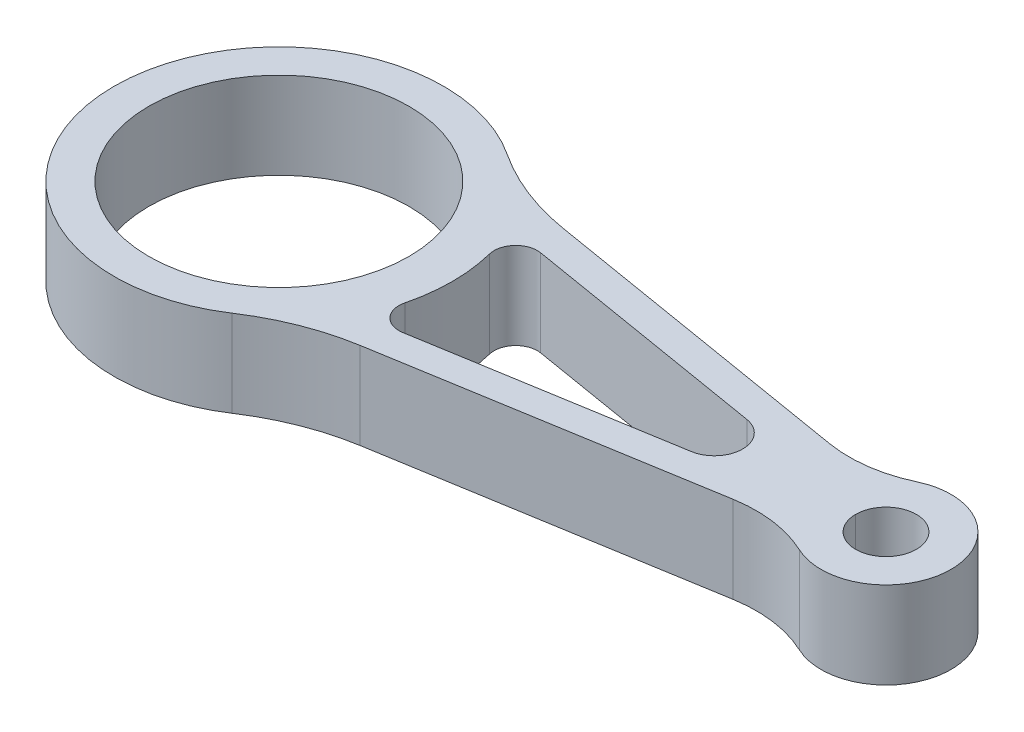
ISO-10303-21;
HEADER;
FILE_DESCRIPTION(('STEP AP214'),'2;1');
FILE_NAME('part.step','',(''),(''),'','','');
FILE_SCHEMA(('AUTOMOTIVE_DESIGN { 1 0 10303 214 1 1 1 1 }'));
ENDSEC;
DATA;
#1=APPLICATION_CONTEXT('core data for automotive mechanical design processes');
#2=APPLICATION_PROTOCOL_DEFINITION('international standard','automotive_design',2000,#1);
#3=PRODUCT_CONTEXT('',#1,'mechanical');
#4=PRODUCT('Part','Part','',(#3));
#5=PRODUCT_RELATED_PRODUCT_CATEGORY('part','',(#4));
#6=PRODUCT_DEFINITION_FORMATION('','',#4);
#7=PRODUCT_DEFINITION_CONTEXT('part definition',#1,'design');
#8=PRODUCT_DEFINITION('design','',#6,#7);
#9=PRODUCT_DEFINITION_SHAPE('','',#8);
#10=(LENGTH_UNIT() NAMED_UNIT(*) SI_UNIT(.MILLI.,.METRE.));
#11=(NAMED_UNIT(*) PLANE_ANGLE_UNIT() SI_UNIT($,.RADIAN.));
#12=(NAMED_UNIT(*) SI_UNIT($,.STERADIAN.) SOLID_ANGLE_UNIT());
#13=UNCERTAINTY_MEASURE_WITH_UNIT(LENGTH_MEASURE(1.E-05),#10,'distance_accuracy_value','');
#14=(GEOMETRIC_REPRESENTATION_CONTEXT(3) GLOBAL_UNCERTAINTY_ASSIGNED_CONTEXT((#13)) GLOBAL_UNIT_ASSIGNED_CONTEXT((#10,
#11,#12)) REPRESENTATION_CONTEXT('',''));
#15=CARTESIAN_POINT('',(0.,0.,0.));
#16=DIRECTION('',(0.,0.,1.));
#17=DIRECTION('',(1.,0.,0.));
#18=AXIS2_PLACEMENT_3D('',#15,#16,#17);
#19=CARTESIAN_POINT('',(140.,10.,0.));
#20=DIRECTION('',(0.,-1.,0.));
#21=DIRECTION('',(0.,0.,-1.));
#22=AXIS2_PLACEMENT_3D('',#19,#20,#21);
#23=CYLINDRICAL_SURFACE('',#22,7.00000000000001);
#24=CARTESIAN_POINT('',(140.,10.,0.));
#25=DIRECTION('',(0.,1.,0.));
#26=DIRECTION('',(0.,0.,1.));
#27=AXIS2_PLACEMENT_3D('',#24,#25,#26);
#28=CIRCLE('',#27,7.00000000000001);
#29=CARTESIAN_POINT('',(147.,10.,0.));
#30=VERTEX_POINT('',#29);
#31=CARTESIAN_POINT('',(133.,10.,0.));
#32=VERTEX_POINT('',#31);
#33=EDGE_CURVE('E230',#30,#32,#28,.T.);
#34=ORIENTED_EDGE('',*,*,#33,.T.);
#35=DIRECTION('',(0.,-1.,0.));
#36=VECTOR('',#35,1.);
#37=CARTESIAN_POINT('',(133.,10.,0.));
#38=LINE('',#37,#36);
#39=CARTESIAN_POINT('',(133.,-10.,0.));
#40=VERTEX_POINT('',#39);
#41=EDGE_CURVE('E11',#32,#40,#38,.T.);
#42=ORIENTED_EDGE('',*,*,#41,.T.);
#43=CARTESIAN_POINT('',(140.,-10.,0.));
#44=DIRECTION('',(0.,1.,0.));
#45=DIRECTION('',(0.,0.,1.));
#46=AXIS2_PLACEMENT_3D('',#43,#44,#45);
#47=CIRCLE('',#46,7.00000000000001);
#48=CARTESIAN_POINT('',(147.,-10.,0.));
#49=VERTEX_POINT('',#48);
#50=EDGE_CURVE('E235',#49,#40,#47,.T.);
#51=ORIENTED_EDGE('',*,*,#50,.F.);
#52=DIRECTION('',(0.,1.,0.));
#53=VECTOR('',#52,1.);
#54=CARTESIAN_POINT('',(147.,10.,0.));
#55=LINE('',#54,#53);
#56=EDGE_CURVE('E52',#49,#30,#55,.T.);
#57=ORIENTED_EDGE('',*,*,#56,.T.);
#58=EDGE_LOOP('',(#34,#42,#51,#57));
#59=FACE_BOUND('',#58,.T.);
#60=ADVANCED_FACE('F43',(#59),#23,.F.);
#61=CARTESIAN_POINT('',(140.,10.,0.));
#62=DIRECTION('',(0.,1.,0.));
#63=DIRECTION('',(0.,0.,1.));
#64=AXIS2_PLACEMENT_3D('',#61,#62,#63);
#65=PLANE('',#64);
#66=CARTESIAN_POINT('',(43.6399445937841,10.,-10.9797648358905));
#67=DIRECTION('',(0.,1.,0.));
#68=DIRECTION('',(0.,0.,1.));
#69=AXIS2_PLACEMENT_3D('',#66,#67,#68);
#70=CIRCLE('',#69,5.);
#71=CARTESIAN_POINT('',(44.4613731652126,10.,-15.9118288158121));
#72=VERTEX_POINT('',#71);
#73=CARTESIAN_POINT('',(38.7910618611414,10.,-9.75979096523596));
#74=VERTEX_POINT('',#73);
#75=EDGE_CURVE('E174',#72,#74,#70,.T.);
#76=ORIENTED_EDGE('',*,*,#75,.F.);
#77=DIRECTION('',(0.986412795984335,0.,0.164285714285714));
#78=VECTOR('',#77,1.);
#79=CARTESIAN_POINT('',(44.4613731652126,10.,-15.9118288158121));
#80=LINE('',#79,#78);
#81=CARTESIAN_POINT('',(101.502639751553,10.,-6.41168317389818));
#82=VERTEX_POINT('',#81);
#83=EDGE_CURVE('E182',#72,#82,#80,.T.);
#84=ORIENTED_EDGE('',*,*,#83,.T.);
#85=CARTESIAN_POINT('',(100.434782608696,10.,0.));
#86=DIRECTION('',(0.,-1.,0.));
#87=DIRECTION('',(0.,0.,-1.));
#88=AXIS2_PLACEMENT_3D('',#85,#86,#87);
#89=CIRCLE('',#88,6.50000000000001);
#90=CARTESIAN_POINT('',(101.502639751553,10.,6.41168317389818));
#91=VERTEX_POINT('',#90);
#92=EDGE_CURVE('E186',#82,#91,#89,.T.);
#93=ORIENTED_EDGE('',*,*,#92,.T.);
#94=DIRECTION('',(-0.986412795984335,0.,0.164285714285714));
#95=VECTOR('',#94,1.);
#96=CARTESIAN_POINT('',(101.502639751553,10.,6.41168317389818));
#97=LINE('',#96,#95);
#98=CARTESIAN_POINT('',(44.4613731652126,10.,15.9118288158121));
#99=VERTEX_POINT('',#98);
#100=EDGE_CURVE('E208',#91,#99,#97,.T.);
#101=ORIENTED_EDGE('',*,*,#100,.T.);
#102=CARTESIAN_POINT('',(43.6399445937841,10.,10.9797648358905));
#103=DIRECTION('',(0.,-1.,0.));
#104=DIRECTION('',(0.,0.,-1.));
#105=AXIS2_PLACEMENT_3D('',#102,#103,#104);
#106=CIRCLE('',#105,5.);
#107=CARTESIAN_POINT('',(38.7910618611414,10.,9.75979096523597));
#108=VERTEX_POINT('',#107);
#109=EDGE_CURVE('E204',#99,#108,#106,.T.);
#110=ORIENTED_EDGE('',*,*,#109,.T.);
#111=CARTESIAN_POINT('',(0.,10.,0.));
#112=DIRECTION('',(0.,1.,0.));
#113=DIRECTION('',(0.,0.,1.));
#114=AXIS2_PLACEMENT_3D('',#111,#112,#113);
#115=CIRCLE('',#114,40.);
#116=EDGE_CURVE('E201',#108,#74,#115,.T.);
#117=ORIENTED_EDGE('',*,*,#116,.T.);
#118=EDGE_LOOP('',(#76,#84,#93,#101,#110,#117));
#119=FACE_BOUND('',#118,.T.);
#120=CARTESIAN_POINT('',(0.,10.,0.));
#121=DIRECTION('',(0.,1.,0.));
#122=DIRECTION('',(0.,0.,1.));
#123=AXIS2_PLACEMENT_3D('',#120,#121,#122);
#124=CIRCLE('',#123,30.);
#125=CARTESIAN_POINT('',(0.,10.,30.));
#126=VERTEX_POINT('',#125);
#127=EDGE_CURVE('E239',#126,#126,#124,.T.);
#128=ORIENTED_EDGE('',*,*,#127,.F.);
#129=EDGE_LOOP('',(#128));
#130=FACE_BOUND('',#129,.T.);
#131=CARTESIAN_POINT('',(0.,10.,0.));
#132=DIRECTION('',(0.,1.,0.));
#133=DIRECTION('',(0.,0.,1.));
#134=AXIS2_PLACEMENT_3D('',#131,#132,#133);
#135=CIRCLE('',#134,38.);
#136=CARTESIAN_POINT('',(20.915316262523,10.,-31.7261650004951));
#137=VERTEX_POINT('',#136);
#138=CARTESIAN_POINT('',(20.915316262523,10.,31.7261650004951));
#139=VERTEX_POINT('',#138);
#140=EDGE_CURVE('E256',#137,#139,#135,.T.);
#141=ORIENTED_EDGE('',*,*,#140,.T.);
#142=CARTESIAN_POINT('',(51.1874845372273,10.,77.645614343317));
#143=DIRECTION('',(0.,1.,0.));
#144=DIRECTION('',(0.,0.,1.));
#145=AXIS2_PLACEMENT_3D('',#142,#143,#144);
#146=CIRCLE('',#145,55.);
#147=CARTESIAN_POINT('',(42.151770251513,10.,23.3929105641786));
#148=VERTEX_POINT('',#147);
#149=EDGE_CURVE('E321',#139,#148,#146,.F.);
#150=ORIENTED_EDGE('',*,*,#149,.T.);
#151=DIRECTION('',(0.986412795984335,0.,-0.164285714285714));
#152=VECTOR('',#151,1.);
#153=CARTESIAN_POINT('',(128.063755469258,10.,9.08438586269532));
#154=LINE('',#153,#152);
#155=CARTESIAN_POINT('',(115.885505271675,10.,11.1126569279176));
#156=VERTEX_POINT('',#155);
#157=EDGE_CURVE('E260',#148,#156,#154,.T.);
#158=ORIENTED_EDGE('',*,*,#157,.T.);
#159=CARTESIAN_POINT('',(120.814076700247,10.,40.7050408074477));
#160=DIRECTION('',(0.,1.,0.));
#161=DIRECTION('',(0.,0.,1.));
#162=AXIS2_PLACEMENT_3D('',#159,#160,#161);
#163=CIRCLE('',#162,30.);
#164=CARTESIAN_POINT('',(133.604692233416,10.,13.5683469358159));
#165=VERTEX_POINT('',#164);
#166=EDGE_CURVE('E295',#156,#165,#163,.F.);
#167=ORIENTED_EDGE('',*,*,#166,.T.);
#168=CARTESIAN_POINT('',(140.,10.,0.));
#169=DIRECTION('',(0.,1.,0.));
#170=DIRECTION('',(0.,0.,1.));
#171=AXIS2_PLACEMENT_3D('',#168,#169,#170);
#172=CIRCLE('',#171,15.);
#173=CARTESIAN_POINT('',(133.604692233416,10.,-13.5683469358159));
#174=VERTEX_POINT('',#173);
#175=EDGE_CURVE('E247',#165,#174,#172,.T.);
#176=ORIENTED_EDGE('',*,*,#175,.T.);
#177=CARTESIAN_POINT('',(120.814076700247,10.,-40.7050408074477));
#178=DIRECTION('',(0.,1.,0.));
#179=DIRECTION('',(0.,0.,1.));
#180=AXIS2_PLACEMENT_3D('',#177,#178,#179);
#181=CIRCLE('',#180,30.);
#182=CARTESIAN_POINT('',(115.885505271675,10.,-11.1126569279176));
#183=VERTEX_POINT('',#182);
#184=EDGE_CURVE('E301',#174,#183,#181,.F.);
#185=ORIENTED_EDGE('',*,*,#184,.T.);
#186=DIRECTION('',(-0.986412795984335,0.,-0.164285714285714));
#187=VECTOR('',#186,1.);
#188=CARTESIAN_POINT('',(128.063755469258,10.,-9.08438586269532));
#189=LINE('',#188,#187);
#190=CARTESIAN_POINT('',(42.151770251513,10.,-23.3929105641786));
#191=VERTEX_POINT('',#190);
#192=EDGE_CURVE('E251',#183,#191,#189,.T.);
#193=ORIENTED_EDGE('',*,*,#192,.T.);
#194=CARTESIAN_POINT('',(51.1874845372273,10.,-77.645614343317));
#195=DIRECTION('',(0.,1.,0.));
#196=DIRECTION('',(0.,0.,1.));
#197=AXIS2_PLACEMENT_3D('',#194,#195,#196);
#198=CIRCLE('',#197,55.);
#199=EDGE_CURVE('E327',#191,#137,#198,.F.);
#200=ORIENTED_EDGE('',*,*,#199,.T.);
#201=EDGE_LOOP('',(#141,#150,#158,#167,#176,#185,#193,#200));
#202=FACE_BOUND('',#201,.T.);
#203=ORIENTED_EDGE('',*,*,#33,.F.);
#204=EDGE_CURVE('E234',#32,#30,#28,.T.);
#205=ORIENTED_EDGE('',*,*,#204,.F.);
#206=EDGE_LOOP('',(#203,#205));
#207=FACE_BOUND('',#206,.T.);
#208=ADVANCED_FACE('F335',(#119,#130,#202,#207),#65,.T.);
#209=CARTESIAN_POINT('',(140.,-10.,0.));
#210=DIRECTION('',(0.,1.,0.));
#211=DIRECTION('',(0.,0.,1.));
#212=AXIS2_PLACEMENT_3D('',#209,#210,#211);
#213=PLANE('',#212);
#214=DIRECTION('',(0.986412795984335,0.,0.164285714285714));
#215=VECTOR('',#214,1.);
#216=CARTESIAN_POINT('',(44.4613731652126,-10.,-15.9118288158121));
#217=LINE('',#216,#215);
#218=CARTESIAN_POINT('',(44.4613731652126,-10.,-15.9118288158121));
#219=VERTEX_POINT('',#218);
#220=CARTESIAN_POINT('',(101.502639751553,-10.,-6.41168317389818));
#221=VERTEX_POINT('',#220);
#222=EDGE_CURVE('E176',#219,#221,#217,.T.);
#223=ORIENTED_EDGE('',*,*,#222,.F.);
#224=CARTESIAN_POINT('',(43.6399445937841,-10.,-10.9797648358905));
#225=DIRECTION('',(0.,1.,0.));
#226=DIRECTION('',(0.,0.,1.));
#227=AXIS2_PLACEMENT_3D('',#224,#225,#226);
#228=CIRCLE('',#227,5.);
#229=CARTESIAN_POINT('',(38.7910618611414,-10.,-9.75979096523596));
#230=VERTEX_POINT('',#229);
#231=EDGE_CURVE('E167',#219,#230,#228,.T.);
#232=ORIENTED_EDGE('',*,*,#231,.T.);
#233=CARTESIAN_POINT('',(0.,-10.,0.));
#234=DIRECTION('',(0.,1.,0.));
#235=DIRECTION('',(0.,0.,1.));
#236=AXIS2_PLACEMENT_3D('',#233,#234,#235);
#237=CIRCLE('',#236,40.);
#238=CARTESIAN_POINT('',(38.7910618611414,-10.,9.75979096523597));
#239=VERTEX_POINT('',#238);
#240=EDGE_CURVE('E154',#239,#230,#237,.T.);
#241=ORIENTED_EDGE('',*,*,#240,.F.);
#242=CARTESIAN_POINT('',(43.6399445937841,-10.,10.9797648358905));
#243=DIRECTION('',(0.,-1.,0.));
#244=DIRECTION('',(0.,0.,-1.));
#245=AXIS2_PLACEMENT_3D('',#242,#243,#244);
#246=CIRCLE('',#245,5.);
#247=CARTESIAN_POINT('',(44.4613731652126,-10.,15.9118288158121));
#248=VERTEX_POINT('',#247);
#249=EDGE_CURVE('E166',#248,#239,#246,.T.);
#250=ORIENTED_EDGE('',*,*,#249,.F.);
#251=DIRECTION('',(-0.986412795984335,0.,0.164285714285714));
#252=VECTOR('',#251,1.);
#253=CARTESIAN_POINT('',(101.502639751553,-10.,6.41168317389818));
#254=LINE('',#253,#252);
#255=CARTESIAN_POINT('',(101.502639751553,-10.,6.41168317389818));
#256=VERTEX_POINT('',#255);
#257=EDGE_CURVE('E191',#256,#248,#254,.T.);
#258=ORIENTED_EDGE('',*,*,#257,.F.);
#259=CARTESIAN_POINT('',(100.434782608696,-10.,0.));
#260=DIRECTION('',(0.,-1.,0.));
#261=DIRECTION('',(0.,0.,-1.));
#262=AXIS2_PLACEMENT_3D('',#259,#260,#261);
#263=CIRCLE('',#262,6.50000000000001);
#264=EDGE_CURVE('E194',#221,#256,#263,.T.);
#265=ORIENTED_EDGE('',*,*,#264,.F.);
#266=EDGE_LOOP('',(#223,#232,#241,#250,#258,#265));
#267=FACE_BOUND('',#266,.T.);
#268=CARTESIAN_POINT('',(140.,-10.,0.));
#269=DIRECTION('',(0.,1.,0.));
#270=DIRECTION('',(0.,0.,1.));
#271=AXIS2_PLACEMENT_3D('',#268,#269,#270);
#272=CIRCLE('',#271,15.);
#273=CARTESIAN_POINT('',(133.604692233416,-10.,13.5683469358159));
#274=VERTEX_POINT('',#273);
#275=CARTESIAN_POINT('',(133.604692233416,-10.,-13.5683469358159));
#276=VERTEX_POINT('',#275);
#277=EDGE_CURVE('E243',#274,#276,#272,.T.);
#278=ORIENTED_EDGE('',*,*,#277,.F.);
#279=CARTESIAN_POINT('',(120.814076700247,-10.,40.7050408074477));
#280=DIRECTION('',(0.,1.,0.));
#281=DIRECTION('',(0.,0.,1.));
#282=AXIS2_PLACEMENT_3D('',#279,#280,#281);
#283=CIRCLE('',#282,30.);
#284=CARTESIAN_POINT('',(115.885505271675,-10.,11.1126569279176));
#285=VERTEX_POINT('',#284);
#286=EDGE_CURVE('E291',#274,#285,#283,.T.);
#287=ORIENTED_EDGE('',*,*,#286,.T.);
#288=DIRECTION('',(0.986412795984335,0.,-0.164285714285714));
#289=VECTOR('',#288,1.);
#290=CARTESIAN_POINT('',(128.063755469258,-10.,9.08438586269532));
#291=LINE('',#290,#289);
#292=CARTESIAN_POINT('',(42.151770251513,-10.,23.3929105641786));
#293=VERTEX_POINT('',#292);
#294=EDGE_CURVE('E252',#293,#285,#291,.T.);
#295=ORIENTED_EDGE('',*,*,#294,.F.);
#296=CARTESIAN_POINT('',(51.1874845372273,-10.,77.645614343317));
#297=DIRECTION('',(0.,1.,0.));
#298=DIRECTION('',(0.,0.,1.));
#299=AXIS2_PLACEMENT_3D('',#296,#297,#298);
#300=CIRCLE('',#299,55.);
#301=CARTESIAN_POINT('',(20.915316262523,-10.,31.7261650004951));
#302=VERTEX_POINT('',#301);
#303=EDGE_CURVE('E318',#293,#302,#300,.T.);
#304=ORIENTED_EDGE('',*,*,#303,.T.);
#305=CARTESIAN_POINT('',(0.,-10.,0.));
#306=DIRECTION('',(0.,1.,0.));
#307=DIRECTION('',(0.,0.,1.));
#308=AXIS2_PLACEMENT_3D('',#305,#306,#307);
#309=CIRCLE('',#308,38.);
#310=CARTESIAN_POINT('',(20.915316262523,-10.,-31.7261650004951));
#311=VERTEX_POINT('',#310);
#312=EDGE_CURVE('E271',#311,#302,#309,.T.);
#313=ORIENTED_EDGE('',*,*,#312,.F.);
#314=CARTESIAN_POINT('',(51.1874845372273,-10.,-77.645614343317));
#315=DIRECTION('',(0.,1.,0.));
#316=DIRECTION('',(0.,0.,1.));
#317=AXIS2_PLACEMENT_3D('',#314,#315,#316);
#318=CIRCLE('',#317,55.);
#319=CARTESIAN_POINT('',(42.151770251513,-10.,-23.3929105641786));
#320=VERTEX_POINT('',#319);
#321=EDGE_CURVE('E324',#311,#320,#318,.T.);
#322=ORIENTED_EDGE('',*,*,#321,.T.);
#323=DIRECTION('',(-0.986412795984335,0.,-0.164285714285714));
#324=VECTOR('',#323,1.);
#325=CARTESIAN_POINT('',(128.063755469258,-10.,-9.08438586269532));
#326=LINE('',#325,#324);
#327=CARTESIAN_POINT('',(115.885505271675,-10.,-11.1126569279176));
#328=VERTEX_POINT('',#327);
#329=EDGE_CURVE('E267',#328,#320,#326,.T.);
#330=ORIENTED_EDGE('',*,*,#329,.F.);
#331=CARTESIAN_POINT('',(120.814076700247,-10.,-40.7050408074477));
#332=DIRECTION('',(0.,1.,0.));
#333=DIRECTION('',(0.,0.,1.));
#334=AXIS2_PLACEMENT_3D('',#331,#332,#333);
#335=CIRCLE('',#334,30.);
#336=EDGE_CURVE('E298',#328,#276,#335,.T.);
#337=ORIENTED_EDGE('',*,*,#336,.T.);
#338=EDGE_LOOP('',(#278,#287,#295,#304,#313,#322,#330,#337));
#339=FACE_BOUND('',#338,.T.);
#340=CARTESIAN_POINT('',(0.,-10.,0.));
#341=DIRECTION('',(0.,1.,0.));
#342=DIRECTION('',(0.,0.,1.));
#343=AXIS2_PLACEMENT_3D('',#340,#341,#342);
#344=CIRCLE('',#343,30.);
#345=CARTESIAN_POINT('',(0.,-10.,30.));
#346=VERTEX_POINT('',#345);
#347=EDGE_CURVE('E233',#346,#346,#344,.T.);
#348=ORIENTED_EDGE('',*,*,#347,.T.);
#349=EDGE_LOOP('',(#348));
#350=FACE_BOUND('',#349,.T.);
#351=ORIENTED_EDGE('',*,*,#50,.T.);
#352=EDGE_CURVE('E218',#40,#49,#47,.T.);
#353=ORIENTED_EDGE('',*,*,#352,.T.);
#354=EDGE_LOOP('',(#351,#353));
#355=FACE_BOUND('',#354,.T.);
#356=ADVANCED_FACE('F178',(#267,#339,#350,#355),#213,.F.);
#357=CARTESIAN_POINT('',(140.,10.,0.));
#358=DIRECTION('',(0.,-1.,0.));
#359=DIRECTION('',(0.,0.,-1.));
#360=AXIS2_PLACEMENT_3D('',#357,#358,#359);
#361=CYLINDRICAL_SURFACE('',#360,15.);
#362=ORIENTED_EDGE('',*,*,#175,.F.);
#363=DIRECTION('',(0.,-1.,0.));
#364=VECTOR('',#363,1.);
#365=CARTESIAN_POINT('',(133.604692233416,10.,13.5683469358159));
#366=LINE('',#365,#364);
#367=EDGE_CURVE('E279',#165,#274,#366,.T.);
#368=ORIENTED_EDGE('',*,*,#367,.T.);
#369=ORIENTED_EDGE('',*,*,#277,.T.);
#370=DIRECTION('',(0.,-1.,0.));
#371=VECTOR('',#370,1.);
#372=CARTESIAN_POINT('',(133.604692233416,10.,-13.5683469358159));
#373=LINE('',#372,#371);
#374=EDGE_CURVE('E263',#276,#174,#373,.F.);
#375=ORIENTED_EDGE('',*,*,#374,.T.);
#376=EDGE_LOOP('',(#362,#368,#369,#375));
#377=FACE_BOUND('',#376,.T.);
#378=ADVANCED_FACE('F361',(#377),#361,.T.);
#379=CARTESIAN_POINT('',(128.063755469258,10.,-9.08438586269532));
#380=DIRECTION('',(-0.164285714285714,0.,0.986412795984335));
#381=DIRECTION('',(0.986412795984335,0.,0.164285714285714));
#382=AXIS2_PLACEMENT_3D('',#379,#380,#381);
#383=PLANE('',#382);
#384=ORIENTED_EDGE('',*,*,#329,.T.);
#385=DIRECTION('',(0.,1.,0.));
#386=VECTOR('',#385,1.);
#387=CARTESIAN_POINT('',(42.1517702515131,10.,-23.3929105641786));
#388=LINE('',#387,#386);
#389=EDGE_CURVE('E315',#320,#191,#388,.T.);
#390=ORIENTED_EDGE('',*,*,#389,.T.);
#391=ORIENTED_EDGE('',*,*,#192,.F.);
#392=DIRECTION('',(0.,1.,0.));
#393=VECTOR('',#392,1.);
#394=CARTESIAN_POINT('',(115.885505271675,-10.,-11.1126569279176));
#395=LINE('',#394,#393);
#396=EDGE_CURVE('E287',#183,#328,#395,.F.);
#397=ORIENTED_EDGE('',*,*,#396,.T.);
#398=EDGE_LOOP('',(#384,#390,#391,#397));
#399=FACE_BOUND('',#398,.T.);
#400=ADVANCED_FACE('F371',(#399),#383,.F.);
#401=CARTESIAN_POINT('',(0.,10.,0.));
#402=DIRECTION('',(0.,-1.,0.));
#403=DIRECTION('',(0.,0.,-1.));
#404=AXIS2_PLACEMENT_3D('',#401,#402,#403);
#405=CYLINDRICAL_SURFACE('',#404,38.);
#406=ORIENTED_EDGE('',*,*,#312,.T.);
#407=DIRECTION('',(0.,-1.,0.));
#408=VECTOR('',#407,1.);
#409=CARTESIAN_POINT('',(20.915316262523,10.,31.7261650004951));
#410=LINE('',#409,#408);
#411=EDGE_CURVE('E312',#302,#139,#410,.F.);
#412=ORIENTED_EDGE('',*,*,#411,.T.);
#413=ORIENTED_EDGE('',*,*,#140,.F.);
#414=DIRECTION('',(0.,-1.,0.));
#415=VECTOR('',#414,1.);
#416=CARTESIAN_POINT('',(20.915316262523,10.,-31.7261650004951));
#417=LINE('',#416,#415);
#418=EDGE_CURVE('E308',#137,#311,#417,.T.);
#419=ORIENTED_EDGE('',*,*,#418,.T.);
#420=EDGE_LOOP('',(#406,#412,#413,#419));
#421=FACE_BOUND('',#420,.T.);
#422=ADVANCED_FACE('F367',(#421),#405,.T.);
#423=CARTESIAN_POINT('',(128.063755469258,10.,9.08438586269532));
#424=DIRECTION('',(-0.164285714285714,0.,-0.986412795984335));
#425=DIRECTION('',(-0.986412795984335,0.,0.164285714285714));
#426=AXIS2_PLACEMENT_3D('',#423,#424,#425);
#427=PLANE('',#426);
#428=ORIENTED_EDGE('',*,*,#157,.F.);
#429=DIRECTION('',(0.,1.,0.));
#430=VECTOR('',#429,1.);
#431=CARTESIAN_POINT('',(42.1517702515131,-10.,23.3929105641786));
#432=LINE('',#431,#430);
#433=EDGE_CURVE('E304',#148,#293,#432,.F.);
#434=ORIENTED_EDGE('',*,*,#433,.T.);
#435=ORIENTED_EDGE('',*,*,#294,.T.);
#436=DIRECTION('',(0.,1.,0.));
#437=VECTOR('',#436,1.);
#438=CARTESIAN_POINT('',(115.885505271675,10.,11.1126569279176));
#439=LINE('',#438,#437);
#440=EDGE_CURVE('E283',#285,#156,#439,.T.);
#441=ORIENTED_EDGE('',*,*,#440,.T.);
#442=EDGE_LOOP('',(#428,#434,#435,#441));
#443=FACE_BOUND('',#442,.T.);
#444=ADVANCED_FACE('F349',(#443),#427,.F.);
#445=CARTESIAN_POINT('',(0.,10.,0.));
#446=DIRECTION('',(0.,-1.,0.));
#447=DIRECTION('',(0.,0.,-1.));
#448=AXIS2_PLACEMENT_3D('',#445,#446,#447);
#449=CYLINDRICAL_SURFACE('',#448,30.);
#450=ORIENTED_EDGE('',*,*,#127,.T.);
#451=EDGE_LOOP('',(#450));
#452=FACE_BOUND('',#451,.T.);
#453=ORIENTED_EDGE('',*,*,#347,.F.);
#454=EDGE_LOOP('',(#453));
#455=FACE_BOUND('',#454,.T.);
#456=ADVANCED_FACE('F341',(#452,#455),#449,.F.);
#457=ORIENTED_EDGE('',*,*,#41,.F.);
#458=ORIENTED_EDGE('',*,*,#204,.T.);
#459=ORIENTED_EDGE('',*,*,#56,.F.);
#460=ORIENTED_EDGE('',*,*,#352,.F.);
#461=EDGE_LOOP('',(#457,#458,#459,#460));
#462=FACE_BOUND('',#461,.T.);
#463=ADVANCED_FACE('F339',(#462),#23,.F.);
#464=CARTESIAN_POINT('',(43.6399445937841,-10.,-10.9797648358905));
#465=DIRECTION('',(0.,1.,0.));
#466=DIRECTION('',(0.,0.,1.));
#467=AXIS2_PLACEMENT_3D('',#464,#465,#466);
#468=CYLINDRICAL_SURFACE('',#467,5.);
#469=ORIENTED_EDGE('',*,*,#75,.T.);
#470=DIRECTION('',(0.,1.,0.));
#471=VECTOR('',#470,1.);
#472=CARTESIAN_POINT('',(38.7910618611414,-10.,-9.75979096523596));
#473=LINE('',#472,#471);
#474=EDGE_CURVE('E158',#230,#74,#473,.T.);
#475=ORIENTED_EDGE('',*,*,#474,.F.);
#476=ORIENTED_EDGE('',*,*,#231,.F.);
#477=DIRECTION('',(0.,1.,0.));
#478=VECTOR('',#477,1.);
#479=CARTESIAN_POINT('',(44.4613731652126,-10.,-15.9118288158121));
#480=LINE('',#479,#478);
#481=EDGE_CURVE('E215',#219,#72,#480,.T.);
#482=ORIENTED_EDGE('',*,*,#481,.T.);
#483=EDGE_LOOP('',(#469,#475,#476,#482));
#484=FACE_BOUND('',#483,.T.);
#485=ADVANCED_FACE('F171',(#484),#468,.F.);
#486=CARTESIAN_POINT('',(44.4613731652126,-10.,-15.9118288158121));
#487=DIRECTION('',(-0.164285714285714,0.,0.986412795984335));
#488=DIRECTION('',(0.986412795984335,0.,0.164285714285714));
#489=AXIS2_PLACEMENT_3D('',#486,#487,#488);
#490=PLANE('',#489);
#491=ORIENTED_EDGE('',*,*,#83,.F.);
#492=ORIENTED_EDGE('',*,*,#481,.F.);
#493=ORIENTED_EDGE('',*,*,#222,.T.);
#494=DIRECTION('',(0.,1.,0.));
#495=VECTOR('',#494,1.);
#496=CARTESIAN_POINT('',(101.502639751553,-10.,-6.41168317389818));
#497=LINE('',#496,#495);
#498=EDGE_CURVE('E219',#221,#82,#497,.T.);
#499=ORIENTED_EDGE('',*,*,#498,.T.);
#500=EDGE_LOOP('',(#491,#492,#493,#499));
#501=FACE_BOUND('',#500,.T.);
#502=ADVANCED_FACE('F347',(#501),#490,.T.);
#503=CARTESIAN_POINT('',(100.434782608696,-10.,0.));
#504=DIRECTION('',(0.,1.,0.));
#505=DIRECTION('',(0.,0.,1.));
#506=AXIS2_PLACEMENT_3D('',#503,#504,#505);
#507=CYLINDRICAL_SURFACE('',#506,6.50000000000001);
#508=ORIENTED_EDGE('',*,*,#92,.F.);
#509=ORIENTED_EDGE('',*,*,#498,.F.);
#510=ORIENTED_EDGE('',*,*,#264,.T.);
#511=DIRECTION('',(0.,1.,0.));
#512=VECTOR('',#511,1.);
#513=CARTESIAN_POINT('',(101.502639751553,-10.,6.41168317389818));
#514=LINE('',#513,#512);
#515=EDGE_CURVE('E222',#256,#91,#514,.T.);
#516=ORIENTED_EDGE('',*,*,#515,.T.);
#517=EDGE_LOOP('',(#508,#509,#510,#516));
#518=FACE_BOUND('',#517,.T.);
#519=ADVANCED_FACE('F483',(#518),#507,.F.);
#520=CARTESIAN_POINT('',(101.502639751553,-10.,6.41168317389818));
#521=DIRECTION('',(-0.164285714285714,0.,-0.986412795984335));
#522=DIRECTION('',(-0.986412795984335,0.,0.164285714285714));
#523=AXIS2_PLACEMENT_3D('',#520,#521,#522);
#524=PLANE('',#523);
#525=ORIENTED_EDGE('',*,*,#100,.F.);
#526=ORIENTED_EDGE('',*,*,#515,.F.);
#527=ORIENTED_EDGE('',*,*,#257,.T.);
#528=DIRECTION('',(0.,1.,0.));
#529=VECTOR('',#528,1.);
#530=CARTESIAN_POINT('',(44.4613731652126,-10.,15.9118288158121));
#531=LINE('',#530,#529);
#532=EDGE_CURVE('E225',#248,#99,#531,.T.);
#533=ORIENTED_EDGE('',*,*,#532,.T.);
#534=EDGE_LOOP('',(#525,#526,#527,#533));
#535=FACE_BOUND('',#534,.T.);
#536=ADVANCED_FACE('F493',(#535),#524,.T.);
#537=CARTESIAN_POINT('',(43.6399445937841,-10.,10.9797648358905));
#538=DIRECTION('',(0.,1.,0.));
#539=DIRECTION('',(0.,0.,1.));
#540=AXIS2_PLACEMENT_3D('',#537,#538,#539);
#541=CYLINDRICAL_SURFACE('',#540,5.);
#542=ORIENTED_EDGE('',*,*,#109,.F.);
#543=ORIENTED_EDGE('',*,*,#532,.F.);
#544=ORIENTED_EDGE('',*,*,#249,.T.);
#545=DIRECTION('',(0.,1.,0.));
#546=VECTOR('',#545,1.);
#547=CARTESIAN_POINT('',(38.7910618611414,-10.,9.75979096523597));
#548=LINE('',#547,#546);
#549=EDGE_CURVE('E160',#239,#108,#548,.T.);
#550=ORIENTED_EDGE('',*,*,#549,.T.);
#551=EDGE_LOOP('',(#542,#543,#544,#550));
#552=FACE_BOUND('',#551,.T.);
#553=ADVANCED_FACE('F503',(#552),#541,.F.);
#554=CARTESIAN_POINT('',(0.,-10.,0.));
#555=DIRECTION('',(0.,1.,0.));
#556=DIRECTION('',(0.,0.,1.));
#557=AXIS2_PLACEMENT_3D('',#554,#555,#556);
#558=CYLINDRICAL_SURFACE('',#557,40.);
#559=ORIENTED_EDGE('',*,*,#116,.F.);
#560=ORIENTED_EDGE('',*,*,#549,.F.);
#561=ORIENTED_EDGE('',*,*,#240,.T.);
#562=ORIENTED_EDGE('',*,*,#474,.T.);
#563=EDGE_LOOP('',(#559,#560,#561,#562));
#564=FACE_BOUND('',#563,.T.);
#565=ADVANCED_FACE('F157',(#564),#558,.T.);
#566=CARTESIAN_POINT('',(120.814076700247,10.,40.7050408074477));
#567=DIRECTION('',(0.,-1.,0.));
#568=DIRECTION('',(0.,0.,-1.));
#569=AXIS2_PLACEMENT_3D('',#566,#567,#568);
#570=CYLINDRICAL_SURFACE('',#569,30.);
#571=ORIENTED_EDGE('',*,*,#166,.F.);
#572=ORIENTED_EDGE('',*,*,#440,.F.);
#573=ORIENTED_EDGE('',*,*,#286,.F.);
#574=ORIENTED_EDGE('',*,*,#367,.F.);
#575=EDGE_LOOP('',(#571,#572,#573,#574));
#576=FACE_BOUND('',#575,.T.);
#577=ADVANCED_FACE('F379',(#576),#570,.F.);
#578=CARTESIAN_POINT('',(120.814076700247,10.,-40.7050408074477));
#579=DIRECTION('',(0.,-1.,0.));
#580=DIRECTION('',(0.,0.,-1.));
#581=AXIS2_PLACEMENT_3D('',#578,#579,#580);
#582=CYLINDRICAL_SURFACE('',#581,30.);
#583=ORIENTED_EDGE('',*,*,#184,.F.);
#584=ORIENTED_EDGE('',*,*,#374,.F.);
#585=ORIENTED_EDGE('',*,*,#336,.F.);
#586=ORIENTED_EDGE('',*,*,#396,.F.);
#587=EDGE_LOOP('',(#583,#584,#585,#586));
#588=FACE_BOUND('',#587,.T.);
#589=ADVANCED_FACE('F382',(#588),#582,.F.);
#590=CARTESIAN_POINT('',(51.1874845372273,10.,77.645614343317));
#591=DIRECTION('',(0.,-1.,0.));
#592=DIRECTION('',(0.,0.,-1.));
#593=AXIS2_PLACEMENT_3D('',#590,#591,#592);
#594=CYLINDRICAL_SURFACE('',#593,55.);
#595=ORIENTED_EDGE('',*,*,#149,.F.);
#596=ORIENTED_EDGE('',*,*,#411,.F.);
#597=ORIENTED_EDGE('',*,*,#303,.F.);
#598=ORIENTED_EDGE('',*,*,#433,.F.);
#599=EDGE_LOOP('',(#595,#596,#597,#598));
#600=FACE_BOUND('',#599,.T.);
#601=ADVANCED_FACE('F385',(#600),#594,.F.);
#602=CARTESIAN_POINT('',(51.1874845372273,10.,-77.645614343317));
#603=DIRECTION('',(0.,-1.,0.));
#604=DIRECTION('',(0.,0.,-1.));
#605=AXIS2_PLACEMENT_3D('',#602,#603,#604);
#606=CYLINDRICAL_SURFACE('',#605,55.);
#607=ORIENTED_EDGE('',*,*,#199,.F.);
#608=ORIENTED_EDGE('',*,*,#389,.F.);
#609=ORIENTED_EDGE('',*,*,#321,.F.);
#610=ORIENTED_EDGE('',*,*,#418,.F.);
#611=EDGE_LOOP('',(#607,#608,#609,#610));
#612=FACE_BOUND('',#611,.T.);
#613=ADVANCED_FACE('F45',(#612),#606,.F.);
#614=CLOSED_SHELL('',(#60,#208,#356,#378,#400,#422,#444,#456,#463,#485,#502,#519,#536,#553,#565,
#577,#589,#601,#613));
#615=MANIFOLD_SOLID_BREP('B2',#614);
#616=ADVANCED_BREP_SHAPE_REPRESENTATION('',(#18,#615),#14);
#617=SHAPE_DEFINITION_REPRESENTATION(#9,#616);
ENDSEC;
END-ISO-10303-21;
